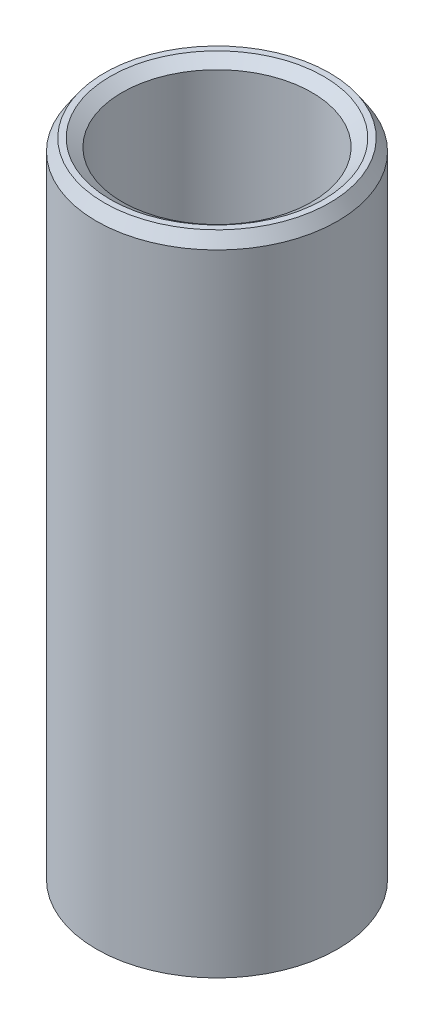
ISO-10303-21;
HEADER;
FILE_DESCRIPTION(('STEP AP214'),'2;1');
FILE_NAME('part.step','',(''),(''),'','','');
FILE_SCHEMA(('AUTOMOTIVE_DESIGN { 1 0 10303 214 1 1 1 1 }'));
ENDSEC;
DATA;
#1=APPLICATION_CONTEXT('core data for automotive mechanical design processes');
#2=APPLICATION_PROTOCOL_DEFINITION('international standard','automotive_design',2000,#1);
#3=PRODUCT_CONTEXT('',#1,'mechanical');
#4=PRODUCT('Part','Part','',(#3));
#5=PRODUCT_RELATED_PRODUCT_CATEGORY('part','',(#4));
#6=PRODUCT_DEFINITION_FORMATION('','',#4);
#7=PRODUCT_DEFINITION_CONTEXT('part definition',#1,'design');
#8=PRODUCT_DEFINITION('design','',#6,#7);
#9=PRODUCT_DEFINITION_SHAPE('','',#8);
#10=(LENGTH_UNIT() NAMED_UNIT(*) SI_UNIT(.MILLI.,.METRE.));
#11=(NAMED_UNIT(*) PLANE_ANGLE_UNIT() SI_UNIT($,.RADIAN.));
#12=(NAMED_UNIT(*) SI_UNIT($,.STERADIAN.) SOLID_ANGLE_UNIT());
#13=UNCERTAINTY_MEASURE_WITH_UNIT(LENGTH_MEASURE(1.E-05),#10,'distance_accuracy_value','');
#14=(GEOMETRIC_REPRESENTATION_CONTEXT(3) GLOBAL_UNCERTAINTY_ASSIGNED_CONTEXT((#13)) GLOBAL_UNIT_ASSIGNED_CONTEXT((#10,
#11,#12)) REPRESENTATION_CONTEXT('',''));
#15=CARTESIAN_POINT('',(0.,0.,0.));
#16=DIRECTION('',(0.,0.,1.));
#17=DIRECTION('',(1.,0.,0.));
#18=AXIS2_PLACEMENT_3D('',#15,#16,#17);
#19=CARTESIAN_POINT('',(0.,161.752572280947,0.));
#20=DIRECTION('',(0.,-1.,0.));
#21=DIRECTION('',(0.,0.,-1.));
#22=AXIS2_PLACEMENT_3D('',#19,#20,#21);
#23=CYLINDRICAL_SURFACE('',#22,30.);
#24=CARTESIAN_POINT('',(0.,1.98725108337927,0.));
#25=DIRECTION('',(0.,1.,0.));
#26=DIRECTION('',(0.,0.,1.));
#27=AXIS2_PLACEMENT_3D('',#24,#25,#26);
#28=CIRCLE('',#27,30.);
#29=CARTESIAN_POINT('',(0.,1.98725108337927,30.));
#30=VERTEX_POINT('',#29);
#31=EDGE_CURVE('E10',#30,#30,#28,.T.);
#32=ORIENTED_EDGE('',*,*,#31,.T.);
#33=EDGE_LOOP('',(#32));
#34=FACE_BOUND('',#33,.T.);
#35=CARTESIAN_POINT('',(0.,158.815943670532,0.));
#36=DIRECTION('',(0.,1.,0.));
#37=DIRECTION('',(0.,0.,1.));
#38=AXIS2_PLACEMENT_3D('',#35,#36,#37);
#39=CIRCLE('',#38,30.);
#40=CARTESIAN_POINT('',(0.,158.815943670532,30.));
#41=VERTEX_POINT('',#40);
#42=EDGE_CURVE('E50',#41,#41,#39,.F.);
#43=ORIENTED_EDGE('',*,*,#42,.T.);
#44=EDGE_LOOP('',(#43));
#45=FACE_BOUND('',#44,.T.);
#46=ADVANCED_FACE('F39',(#34,#45),#23,.T.);
#47=CARTESIAN_POINT('',(0.,161.752572280947,0.));
#48=DIRECTION('',(0.,1.,0.));
#49=DIRECTION('',(0.,0.,1.));
#50=AXIS2_PLACEMENT_3D('',#47,#48,#49);
#51=PLANE('',#50);
#52=CARTESIAN_POINT('',(0.,161.752572280947,0.));
#53=DIRECTION('',(0.,1.,0.));
#54=DIRECTION('',(0.,0.,1.));
#55=AXIS2_PLACEMENT_3D('',#52,#53,#54);
#56=CIRCLE('',#55,26.5335969653483);
#57=CARTESIAN_POINT('',(0.,161.752572280947,26.5335969653483));
#58=VERTEX_POINT('',#57);
#59=EDGE_CURVE('E58',#58,#58,#56,.F.);
#60=ORIENTED_EDGE('',*,*,#59,.T.);
#61=EDGE_LOOP('',(#60));
#62=FACE_BOUND('',#61,.T.);
#63=CARTESIAN_POINT('',(0.,161.752572280947,0.));
#64=DIRECTION('',(0.,1.,0.));
#65=DIRECTION('',(0.,0.,1.));
#66=AXIS2_PLACEMENT_3D('',#63,#64,#65);
#67=CIRCLE('',#66,28.0127489166207);
#68=CARTESIAN_POINT('',(0.,161.752572280947,28.0127489166207));
#69=VERTEX_POINT('',#68);
#70=EDGE_CURVE('E61',#69,#69,#67,.T.);
#71=ORIENTED_EDGE('',*,*,#70,.T.);
#72=EDGE_LOOP('',(#71));
#73=FACE_BOUND('',#72,.T.);
#74=ADVANCED_FACE('F88',(#62,#73),#51,.T.);
#75=CARTESIAN_POINT('',(0.,0.,0.));
#76=DIRECTION('',(0.,1.,0.));
#77=DIRECTION('',(0.,0.,1.));
#78=AXIS2_PLACEMENT_3D('',#75,#76,#77);
#79=PLANE('',#78);
#80=CARTESIAN_POINT('',(0.,0.,0.));
#81=DIRECTION('',(0.,1.,0.));
#82=DIRECTION('',(0.,0.,1.));
#83=AXIS2_PLACEMENT_3D('',#80,#81,#82);
#84=CIRCLE('',#83,25.584219438313);
#85=CARTESIAN_POINT('',(0.,0.,25.584219438313));
#86=VERTEX_POINT('',#85);
#87=EDGE_CURVE('E51',#86,#86,#84,.T.);
#88=ORIENTED_EDGE('',*,*,#87,.T.);
#89=EDGE_LOOP('',(#88));
#90=FACE_BOUND('',#89,.T.);
#91=CARTESIAN_POINT('',(0.,0.,0.));
#92=DIRECTION('',(0.,1.,0.));
#93=DIRECTION('',(0.,0.,1.));
#94=AXIS2_PLACEMENT_3D('',#91,#92,#93);
#95=CIRCLE('',#94,27.0633713895854);
#96=CARTESIAN_POINT('',(0.,0.,27.0633713895854));
#97=VERTEX_POINT('',#96);
#98=EDGE_CURVE('E54',#97,#97,#95,.F.);
#99=ORIENTED_EDGE('',*,*,#98,.T.);
#100=EDGE_LOOP('',(#99));
#101=FACE_BOUND('',#100,.T.);
#102=ADVANCED_FACE('F83',(#90,#101),#79,.F.);
#103=CARTESIAN_POINT('',(0.,161.752572280947,0.));
#104=DIRECTION('',(0.,-1.,0.));
#105=DIRECTION('',(0.,0.,-1.));
#106=AXIS2_PLACEMENT_3D('',#103,#104,#105);
#107=CYLINDRICAL_SURFACE('',#106,23.5969683549337);
#108=CARTESIAN_POINT('',(0.,159.765321197567,0.));
#109=DIRECTION('',(0.,1.,0.));
#110=DIRECTION('',(0.,0.,1.));
#111=AXIS2_PLACEMENT_3D('',#108,#109,#110);
#112=CIRCLE('',#111,23.5969683549337);
#113=CARTESIAN_POINT('',(0.,159.765321197567,23.5969683549337));
#114=VERTEX_POINT('',#113);
#115=EDGE_CURVE('E67',#114,#114,#112,.T.);
#116=ORIENTED_EDGE('',*,*,#115,.T.);
#117=EDGE_LOOP('',(#116));
#118=FACE_BOUND('',#117,.T.);
#119=CARTESIAN_POINT('',(0.,2.93662861041458,0.));
#120=DIRECTION('',(0.,1.,0.));
#121=DIRECTION('',(0.,0.,1.));
#122=AXIS2_PLACEMENT_3D('',#119,#120,#121);
#123=CIRCLE('',#122,23.5969683549337);
#124=CARTESIAN_POINT('',(0.,2.93662861041458,23.5969683549337));
#125=VERTEX_POINT('',#124);
#126=EDGE_CURVE('E69',#125,#125,#123,.F.);
#127=ORIENTED_EDGE('',*,*,#126,.T.);
#128=EDGE_LOOP('',(#127));
#129=FACE_BOUND('',#128,.T.);
#130=ADVANCED_FACE('F71',(#118,#129),#107,.F.);
#131=CARTESIAN_POINT('',(0.,159.765321197567,0.));
#132=DIRECTION('',(0.,1.,0.));
#133=DIRECTION('',(0.,0.,1.));
#134=AXIS2_PLACEMENT_3D('',#131,#132,#133);
#135=CONICAL_SURFACE('',#134,23.5969683549337,0.975871638601482);
#136=ORIENTED_EDGE('',*,*,#59,.F.);
#137=EDGE_LOOP('',(#136));
#138=FACE_BOUND('',#137,.T.);
#139=ORIENTED_EDGE('',*,*,#115,.F.);
#140=EDGE_LOOP('',(#139));
#141=FACE_BOUND('',#140,.T.);
#142=ADVANCED_FACE('F77',(#138,#141),#135,.F.);
#143=CARTESIAN_POINT('',(0.,0.,0.));
#144=DIRECTION('',(0.,-1.,0.));
#145=DIRECTION('',(0.,0.,-1.));
#146=AXIS2_PLACEMENT_3D('',#143,#144,#145);
#147=CONICAL_SURFACE('',#146,25.584219438313,0.594924688193413);
#148=ORIENTED_EDGE('',*,*,#126,.F.);
#149=EDGE_LOOP('',(#148));
#150=FACE_BOUND('',#149,.T.);
#151=ORIENTED_EDGE('',*,*,#87,.F.);
#152=EDGE_LOOP('',(#151));
#153=FACE_BOUND('',#152,.T.);
#154=ADVANCED_FACE('F73',(#150,#153),#147,.F.);
#155=CARTESIAN_POINT('',(0.,1.98725108337927,0.));
#156=DIRECTION('',(0.,1.,0.));
#157=DIRECTION('',(0.,0.,1.));
#158=AXIS2_PLACEMENT_3D('',#155,#156,#157);
#159=CONICAL_SURFACE('',#158,30.,0.975871638601485);
#160=ORIENTED_EDGE('',*,*,#98,.F.);
#161=EDGE_LOOP('',(#160));
#162=FACE_BOUND('',#161,.T.);
#163=ORIENTED_EDGE('',*,*,#31,.F.);
#164=EDGE_LOOP('',(#163));
#165=FACE_BOUND('',#164,.T.);
#166=ADVANCED_FACE('F76',(#162,#165),#159,.T.);
#167=CARTESIAN_POINT('',(0.,161.752572280947,0.));
#168=DIRECTION('',(0.,-1.,0.));
#169=DIRECTION('',(0.,0.,-1.));
#170=AXIS2_PLACEMENT_3D('',#167,#168,#169);
#171=CONICAL_SURFACE('',#170,28.0127489166207,0.594924688193411);
#172=ORIENTED_EDGE('',*,*,#42,.F.);
#173=EDGE_LOOP('',(#172));
#174=FACE_BOUND('',#173,.T.);
#175=ORIENTED_EDGE('',*,*,#70,.F.);
#176=EDGE_LOOP('',(#175));
#177=FACE_BOUND('',#176,.T.);
#178=ADVANCED_FACE('F45',(#174,#177),#171,.T.);
#179=CLOSED_SHELL('',(#46,#74,#102,#130,#142,#154,#166,#178));
#180=MANIFOLD_SOLID_BREP('B2',#179);
#181=ADVANCED_BREP_SHAPE_REPRESENTATION('',(#18,#180),#14);
#182=SHAPE_DEFINITION_REPRESENTATION(#9,#181);
ENDSEC;
END-ISO-10303-21;
